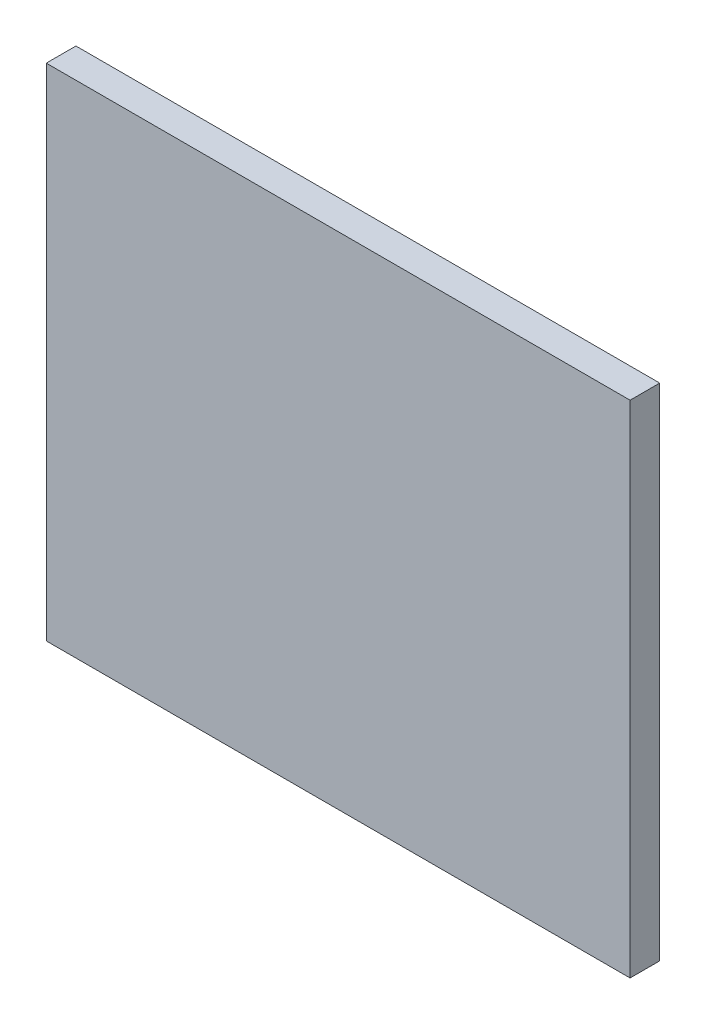
ISO-10303-21;
HEADER;
FILE_DESCRIPTION(('STEP AP214'),'2;1');
FILE_NAME('part.step','',(''),(''),'','','');
FILE_SCHEMA(('AUTOMOTIVE_DESIGN { 1 0 10303 214 1 1 1 1 }'));
ENDSEC;
DATA;
#1=APPLICATION_CONTEXT('core data for automotive mechanical design processes');
#2=APPLICATION_PROTOCOL_DEFINITION('international standard','automotive_design',2000,#1);
#3=PRODUCT_CONTEXT('',#1,'mechanical');
#4=PRODUCT('Part','Part','',(#3));
#5=PRODUCT_RELATED_PRODUCT_CATEGORY('part','',(#4));
#6=PRODUCT_DEFINITION_FORMATION('','',#4);
#7=PRODUCT_DEFINITION_CONTEXT('part definition',#1,'design');
#8=PRODUCT_DEFINITION('design','',#6,#7);
#9=PRODUCT_DEFINITION_SHAPE('','',#8);
#10=(LENGTH_UNIT() NAMED_UNIT(*) SI_UNIT(.MILLI.,.METRE.));
#11=(NAMED_UNIT(*) PLANE_ANGLE_UNIT() SI_UNIT($,.RADIAN.));
#12=(NAMED_UNIT(*) SI_UNIT($,.STERADIAN.) SOLID_ANGLE_UNIT());
#13=UNCERTAINTY_MEASURE_WITH_UNIT(LENGTH_MEASURE(1.E-05),#10,'distance_accuracy_value','');
#14=(GEOMETRIC_REPRESENTATION_CONTEXT(3) GLOBAL_UNCERTAINTY_ASSIGNED_CONTEXT((#13)) GLOBAL_UNIT_ASSIGNED_CONTEXT((#10,
#11,#12)) REPRESENTATION_CONTEXT('',''));
#15=CARTESIAN_POINT('',(0.,0.,0.));
#16=DIRECTION('',(0.,0.,1.));
#17=DIRECTION('',(1.,0.,0.));
#18=AXIS2_PLACEMENT_3D('',#15,#16,#17);
#19=CARTESIAN_POINT('',(94.9169998168945,83.8870010375977,0.));
#20=DIRECTION('',(0.,1.,0.));
#21=DIRECTION('',(1.,0.,0.));
#22=AXIS2_PLACEMENT_3D('',#19,#20,#21);
#23=PLANE('',#22);
#24=DIRECTION('',(1.,0.,0.));
#25=VECTOR('',#24,1.);
#26=CARTESIAN_POINT('',(94.9169998168945,83.8870010375977,0.03556));
#27=LINE('',#26,#25);
#28=CARTESIAN_POINT('',(94.9169998168945,83.8870010375977,0.03556));
#29=VERTEX_POINT('',#28);
#30=CARTESIAN_POINT('',(95.6169967651367,83.8870010375977,0.03556));
#31=VERTEX_POINT('',#30);
#32=EDGE_CURVE('E11',#29,#31,#27,.T.);
#33=ORIENTED_EDGE('',*,*,#32,.F.);
#34=DIRECTION('',(0.,0.,1.));
#35=VECTOR('',#34,1.);
#36=CARTESIAN_POINT('',(94.9169998168945,83.8870010375977,0.));
#37=LINE('',#36,#35);
#38=CARTESIAN_POINT('',(94.9169998168945,83.8870010375977,0.));
#39=VERTEX_POINT('',#38);
#40=EDGE_CURVE('E24',#39,#29,#37,.T.);
#41=ORIENTED_EDGE('',*,*,#40,.F.);
#42=DIRECTION('',(1.,0.,0.));
#43=VECTOR('',#42,1.);
#44=CARTESIAN_POINT('',(94.9169998168945,83.8870010375977,0.));
#45=LINE('',#44,#43);
#46=CARTESIAN_POINT('',(95.6169967651367,83.8870010375977,0.));
#47=VERTEX_POINT('',#46);
#48=EDGE_CURVE('E75',#39,#47,#45,.T.);
#49=ORIENTED_EDGE('',*,*,#48,.T.);
#50=DIRECTION('',(0.,0.,1.));
#51=VECTOR('',#50,1.);
#52=CARTESIAN_POINT('',(95.6169967651367,83.8870010375977,0.));
#53=LINE('',#52,#51);
#54=EDGE_CURVE('E37',#47,#31,#53,.T.);
#55=ORIENTED_EDGE('',*,*,#54,.T.);
#56=EDGE_LOOP('',(#33,#41,#49,#55));
#57=FACE_BOUND('',#56,.T.);
#58=ADVANCED_FACE('F17',(#57),#23,.F.);
#59=CARTESIAN_POINT('',(95.6169967651367,83.8870010375977,0.));
#60=DIRECTION('',(-1.,0.,0.));
#61=DIRECTION('',(0.,1.,0.));
#62=AXIS2_PLACEMENT_3D('',#59,#60,#61);
#63=PLANE('',#62);
#64=DIRECTION('',(0.,1.,0.));
#65=VECTOR('',#64,1.);
#66=CARTESIAN_POINT('',(95.6169967651367,83.8870010375977,0.03556));
#67=LINE('',#66,#65);
#68=CARTESIAN_POINT('',(95.6169967651367,84.4869995117188,0.03556));
#69=VERTEX_POINT('',#68);
#70=EDGE_CURVE('E83',#31,#69,#67,.T.);
#71=ORIENTED_EDGE('',*,*,#70,.F.);
#72=ORIENTED_EDGE('',*,*,#54,.F.);
#73=DIRECTION('',(0.,1.,0.));
#74=VECTOR('',#73,1.);
#75=CARTESIAN_POINT('',(95.6169967651367,83.8870010375977,0.));
#76=LINE('',#75,#74);
#77=CARTESIAN_POINT('',(95.6169967651367,84.4869995117188,0.));
#78=VERTEX_POINT('',#77);
#79=EDGE_CURVE('E81',#47,#78,#76,.T.);
#80=ORIENTED_EDGE('',*,*,#79,.T.);
#81=DIRECTION('',(0.,0.,1.));
#82=VECTOR('',#81,1.);
#83=CARTESIAN_POINT('',(95.6169967651367,84.4869995117188,0.));
#84=LINE('',#83,#82);
#85=EDGE_CURVE('E67',#78,#69,#84,.T.);
#86=ORIENTED_EDGE('',*,*,#85,.T.);
#87=EDGE_LOOP('',(#71,#72,#80,#86));
#88=FACE_BOUND('',#87,.T.);
#89=ADVANCED_FACE('F89',(#88),#63,.F.);
#90=CARTESIAN_POINT('',(95.6169967651367,84.4869995117188,0.));
#91=DIRECTION('',(0.,-1.,0.));
#92=DIRECTION('',(-1.,0.,0.));
#93=AXIS2_PLACEMENT_3D('',#90,#91,#92);
#94=PLANE('',#93);
#95=DIRECTION('',(-1.,0.,0.));
#96=VECTOR('',#95,1.);
#97=CARTESIAN_POINT('',(95.6169967651367,84.4869995117188,0.03556));
#98=LINE('',#97,#96);
#99=CARTESIAN_POINT('',(94.9169998168945,84.4869995117188,0.03556));
#100=VERTEX_POINT('',#99);
#101=EDGE_CURVE('E71',#69,#100,#98,.T.);
#102=ORIENTED_EDGE('',*,*,#101,.F.);
#103=ORIENTED_EDGE('',*,*,#85,.F.);
#104=DIRECTION('',(-1.,0.,0.));
#105=VECTOR('',#104,1.);
#106=CARTESIAN_POINT('',(95.6169967651367,84.4869995117188,0.));
#107=LINE('',#106,#105);
#108=CARTESIAN_POINT('',(94.9169998168945,84.4869995117188,0.));
#109=VERTEX_POINT('',#108);
#110=EDGE_CURVE('E63',#78,#109,#107,.T.);
#111=ORIENTED_EDGE('',*,*,#110,.T.);
#112=DIRECTION('',(0.,0.,1.));
#113=VECTOR('',#112,1.);
#114=CARTESIAN_POINT('',(94.9169998168945,84.4869995117188,0.));
#115=LINE('',#114,#113);
#116=EDGE_CURVE('E53',#109,#100,#115,.T.);
#117=ORIENTED_EDGE('',*,*,#116,.T.);
#118=EDGE_LOOP('',(#102,#103,#111,#117));
#119=FACE_BOUND('',#118,.T.);
#120=ADVANCED_FACE('F66',(#119),#94,.F.);
#121=CARTESIAN_POINT('',(94.9169998168945,84.4869995117188,0.));
#122=DIRECTION('',(1.,0.,0.));
#123=DIRECTION('',(0.,-1.,0.));
#124=AXIS2_PLACEMENT_3D('',#121,#122,#123);
#125=PLANE('',#124);
#126=DIRECTION('',(0.,-1.,0.));
#127=VECTOR('',#126,1.);
#128=CARTESIAN_POINT('',(94.9169998168945,84.4869995117188,0.03556));
#129=LINE('',#128,#127);
#130=EDGE_CURVE('E59',#100,#29,#129,.T.);
#131=ORIENTED_EDGE('',*,*,#130,.F.);
#132=ORIENTED_EDGE('',*,*,#116,.F.);
#133=DIRECTION('',(0.,-1.,0.));
#134=VECTOR('',#133,1.);
#135=CARTESIAN_POINT('',(94.9169998168945,84.4869995117188,0.));
#136=LINE('',#135,#134);
#137=EDGE_CURVE('E57',#109,#39,#136,.T.);
#138=ORIENTED_EDGE('',*,*,#137,.T.);
#139=ORIENTED_EDGE('',*,*,#40,.T.);
#140=EDGE_LOOP('',(#131,#132,#138,#139));
#141=FACE_BOUND('',#140,.T.);
#142=ADVANCED_FACE('F55',(#141),#125,.F.);
#143=CARTESIAN_POINT('',(94.9169998168945,83.8870010375977,0.));
#144=DIRECTION('',(0.,0.,-1.));
#145=DIRECTION('',(-1.,0.,0.));
#146=AXIS2_PLACEMENT_3D('',#143,#144,#145);
#147=PLANE('',#146);
#148=ORIENTED_EDGE('',*,*,#137,.F.);
#149=ORIENTED_EDGE('',*,*,#110,.F.);
#150=ORIENTED_EDGE('',*,*,#79,.F.);
#151=ORIENTED_EDGE('',*,*,#48,.F.);
#152=EDGE_LOOP('',(#148,#149,#150,#151));
#153=FACE_BOUND('',#152,.T.);
#154=ADVANCED_FACE('F74',(#153),#147,.T.);
#155=CARTESIAN_POINT('',(94.9169998168945,83.8870010375977,0.03556));
#156=DIRECTION('',(0.,0.,-1.));
#157=DIRECTION('',(-1.,0.,0.));
#158=AXIS2_PLACEMENT_3D('',#155,#156,#157);
#159=PLANE('',#158);
#160=ORIENTED_EDGE('',*,*,#32,.T.);
#161=ORIENTED_EDGE('',*,*,#70,.T.);
#162=ORIENTED_EDGE('',*,*,#101,.T.);
#163=ORIENTED_EDGE('',*,*,#130,.T.);
#164=EDGE_LOOP('',(#160,#161,#162,#163));
#165=FACE_BOUND('',#164,.T.);
#166=ADVANCED_FACE('F91',(#165),#159,.F.);
#167=CLOSED_SHELL('',(#58,#89,#120,#142,#154,#166));
#168=MANIFOLD_SOLID_BREP('B1',#167);
#169=ADVANCED_BREP_SHAPE_REPRESENTATION('',(#18,#168),#14);
#170=SHAPE_DEFINITION_REPRESENTATION(#9,#169);
ENDSEC;
END-ISO-10303-21;
